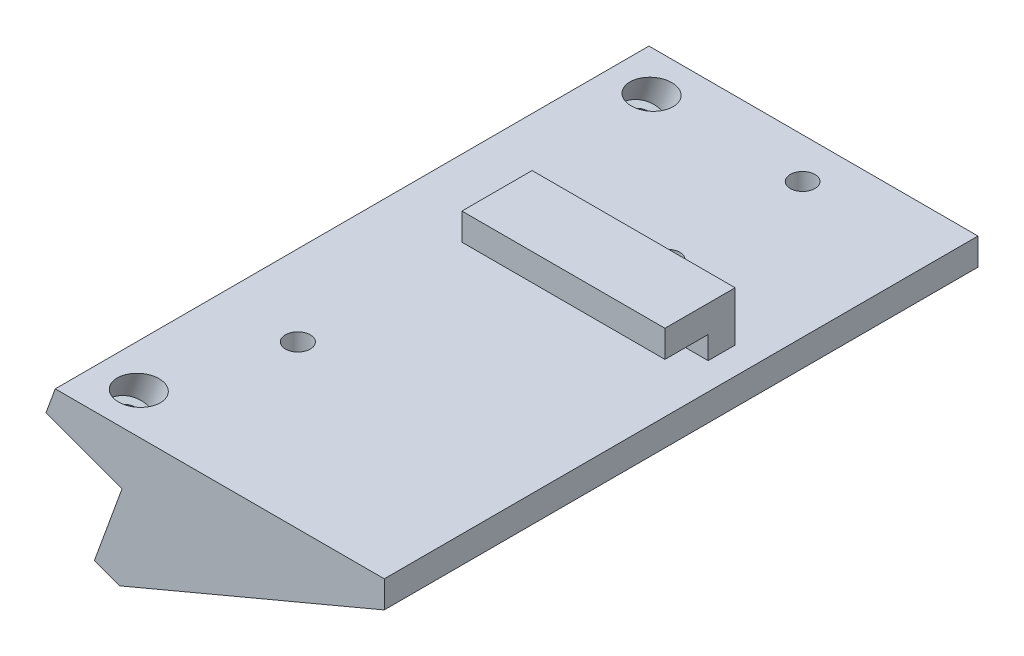
ISO-10303-21;
HEADER;
FILE_DESCRIPTION(('STEP AP214'),'2;1');
FILE_NAME('part.step','',(''),(''),'','','');
FILE_SCHEMA(('AUTOMOTIVE_DESIGN { 1 0 10303 214 1 1 1 1 }'));
ENDSEC;
DATA;
#1=APPLICATION_CONTEXT('core data for automotive mechanical design processes');
#2=APPLICATION_PROTOCOL_DEFINITION('international standard','automotive_design',2000,#1);
#3=PRODUCT_CONTEXT('',#1,'mechanical');
#4=PRODUCT('Part','Part','',(#3));
#5=PRODUCT_RELATED_PRODUCT_CATEGORY('part','',(#4));
#6=PRODUCT_DEFINITION_FORMATION('','',#4);
#7=PRODUCT_DEFINITION_CONTEXT('part definition',#1,'design');
#8=PRODUCT_DEFINITION('design','',#6,#7);
#9=PRODUCT_DEFINITION_SHAPE('','',#8);
#10=(LENGTH_UNIT() NAMED_UNIT(*) SI_UNIT(.MILLI.,.METRE.));
#11=(NAMED_UNIT(*) PLANE_ANGLE_UNIT() SI_UNIT($,.RADIAN.));
#12=(NAMED_UNIT(*) SI_UNIT($,.STERADIAN.) SOLID_ANGLE_UNIT());
#13=UNCERTAINTY_MEASURE_WITH_UNIT(LENGTH_MEASURE(1.E-05),#10,'distance_accuracy_value','');
#14=(GEOMETRIC_REPRESENTATION_CONTEXT(3) GLOBAL_UNCERTAINTY_ASSIGNED_CONTEXT((#13)) GLOBAL_UNIT_ASSIGNED_CONTEXT((#10,
#11,#12)) REPRESENTATION_CONTEXT('',''));
#15=CARTESIAN_POINT('',(0.,0.,0.));
#16=DIRECTION('',(0.,0.,1.));
#17=DIRECTION('',(1.,0.,0.));
#18=AXIS2_PLACEMENT_3D('',#15,#16,#17);
#19=CARTESIAN_POINT('',(0.,0.,0.));
#20=DIRECTION('',(0.,0.,-1.));
#21=DIRECTION('',(-1.,0.,0.));
#22=AXIS2_PLACEMENT_3D('',#19,#20,#21);
#23=PLANE('',#22);
#24=DIRECTION('',(0.,-1.,0.));
#25=VECTOR('',#24,1.);
#26=CARTESIAN_POINT('',(48.7076801418633,28.1241545656032,0.));
#27=LINE('',#26,#25);
#28=CARTESIAN_POINT('',(48.7076801418633,28.1241545656032,0.));
#29=VERTEX_POINT('',#28);
#30=CARTESIAN_POINT('',(48.7076801418633,23.9241545656032,0.));
#31=VERTEX_POINT('',#30);
#32=EDGE_CURVE('E147',#29,#31,#27,.T.);
#33=ORIENTED_EDGE('',*,*,#32,.F.);
#34=DIRECTION('',(1.,0.,0.));
#35=VECTOR('',#34,1.);
#36=CARTESIAN_POINT('',(-5.72631146135729,28.1241545656032,0.));
#37=LINE('',#36,#35);
#38=CARTESIAN_POINT('',(11.0935397099737,28.1241545656032,0.));
#39=VERTEX_POINT('',#38);
#40=EDGE_CURVE('E247',#39,#29,#37,.T.);
#41=ORIENTED_EDGE('',*,*,#40,.F.);
#42=DIRECTION('',(0.,-1.,0.));
#43=VECTOR('',#42,1.);
#44=CARTESIAN_POINT('',(11.0935397099737,0.,0.));
#45=LINE('',#44,#43);
#46=CARTESIAN_POINT('',(11.0935397099737,23.9241545656032,0.));
#47=VERTEX_POINT('',#46);
#48=EDGE_CURVE('E158',#39,#47,#45,.T.);
#49=ORIENTED_EDGE('',*,*,#48,.T.);
#50=DIRECTION('',(-1.,0.,0.));
#51=VECTOR('',#50,1.);
#52=CARTESIAN_POINT('',(-7.25498644527533,23.9241545656032,0.));
#53=LINE('',#52,#51);
#54=EDGE_CURVE('E143',#31,#47,#53,.T.);
#55=ORIENTED_EDGE('',*,*,#54,.F.);
#56=EDGE_LOOP('',(#33,#41,#49,#55));
#57=FACE_BOUND('',#56,.T.);
#58=ADVANCED_FACE('F41',(#57),#23,.F.);
#59=CARTESIAN_POINT('',(-3.9064602900263,33.1241545656032,-5.));
#60=DIRECTION('',(0.,-1.,0.));
#61=DIRECTION('',(1.,0.,0.));
#62=AXIS2_PLACEMENT_3D('',#59,#60,#61);
#63=PLANE('',#62);
#64=DIRECTION('',(0.,0.,1.));
#65=VECTOR('',#64,1.);
#66=CARTESIAN_POINT('',(48.7076801418633,33.1241545656032,-5.));
#67=LINE('',#66,#65);
#68=CARTESIAN_POINT('',(48.7076801418633,33.1241545656032,-5.));
#69=VERTEX_POINT('',#68);
#70=CARTESIAN_POINT('',(48.7076801418633,33.1241545656032,8.));
#71=VERTEX_POINT('',#70);
#72=EDGE_CURVE('E58',#69,#71,#67,.T.);
#73=ORIENTED_EDGE('',*,*,#72,.F.);
#74=DIRECTION('',(1.,0.,0.));
#75=VECTOR('',#74,1.);
#76=CARTESIAN_POINT('',(-3.9064602900263,33.1241545656032,-5.));
#77=LINE('',#76,#75);
#78=CARTESIAN_POINT('',(11.0935397099737,33.1241545656032,-5.));
#79=VERTEX_POINT('',#78);
#80=EDGE_CURVE('E160',#79,#69,#77,.T.);
#81=ORIENTED_EDGE('',*,*,#80,.F.);
#82=DIRECTION('',(0.,0.,1.));
#83=VECTOR('',#82,1.);
#84=CARTESIAN_POINT('',(11.0935397099737,33.1241545656032,-5.));
#85=LINE('',#84,#83);
#86=CARTESIAN_POINT('',(11.0935397099737,33.1241545656032,8.));
#87=VERTEX_POINT('',#86);
#88=EDGE_CURVE('E237',#79,#87,#85,.T.);
#89=ORIENTED_EDGE('',*,*,#88,.T.);
#90=DIRECTION('',(-1.,0.,0.));
#91=VECTOR('',#90,1.);
#92=CARTESIAN_POINT('',(53.7076801418633,33.1241545656032,8.));
#93=LINE('',#92,#91);
#94=EDGE_CURVE('E250',#71,#87,#93,.T.);
#95=ORIENTED_EDGE('',*,*,#94,.F.);
#96=EDGE_LOOP('',(#73,#81,#89,#95));
#97=FACE_BOUND('',#96,.T.);
#98=ADVANCED_FACE('F311',(#97),#63,.F.);
#99=CARTESIAN_POINT('',(0.,0.,-5.));
#100=DIRECTION('',(0.,0.,-1.));
#101=DIRECTION('',(-1.,0.,0.));
#102=AXIS2_PLACEMENT_3D('',#99,#100,#101);
#103=PLANE('',#102);
#104=ORIENTED_EDGE('',*,*,#80,.T.);
#105=DIRECTION('',(0.,1.,0.));
#106=VECTOR('',#105,1.);
#107=CARTESIAN_POINT('',(48.7076801418633,33.1241545656032,-5.));
#108=LINE('',#107,#106);
#109=CARTESIAN_POINT('',(48.7076801418633,23.9241545656032,-5.));
#110=VERTEX_POINT('',#109);
#111=EDGE_CURVE('E146',#110,#69,#108,.T.);
#112=ORIENTED_EDGE('',*,*,#111,.F.);
#113=DIRECTION('',(1.,0.,0.));
#114=VECTOR('',#113,1.);
#115=CARTESIAN_POINT('',(-7.25498644527533,23.9241545656032,-5.));
#116=LINE('',#115,#114);
#117=CARTESIAN_POINT('',(11.0935397099737,23.9241545656032,-5.));
#118=VERTEX_POINT('',#117);
#119=EDGE_CURVE('E11',#118,#110,#116,.T.);
#120=ORIENTED_EDGE('',*,*,#119,.F.);
#121=DIRECTION('',(0.,1.,0.));
#122=VECTOR('',#121,1.);
#123=CARTESIAN_POINT('',(11.0935397099737,23.9241545656032,-5.));
#124=LINE('',#123,#122);
#125=EDGE_CURVE('E232',#118,#79,#124,.T.);
#126=ORIENTED_EDGE('',*,*,#125,.T.);
#127=EDGE_LOOP('',(#104,#112,#120,#126));
#128=FACE_BOUND('',#127,.T.);
#129=ADVANCED_FACE('F317',(#128),#103,.T.);
#130=CARTESIAN_POINT('',(-5.72631146135729,28.1241545656032,8.));
#131=DIRECTION('',(0.,1.,0.));
#132=DIRECTION('',(0.,0.,1.));
#133=AXIS2_PLACEMENT_3D('',#130,#131,#132);
#134=PLANE('',#133);
#135=DIRECTION('',(0.,0.,-1.));
#136=VECTOR('',#135,1.);
#137=CARTESIAN_POINT('',(48.7076801418633,28.1241545656032,8.));
#138=LINE('',#137,#136);
#139=CARTESIAN_POINT('',(48.7076801418633,28.1241545656032,8.));
#140=VERTEX_POINT('',#139);
#141=EDGE_CURVE('E152',#140,#29,#138,.T.);
#142=ORIENTED_EDGE('',*,*,#141,.F.);
#143=DIRECTION('',(1.,0.,0.));
#144=VECTOR('',#143,1.);
#145=CARTESIAN_POINT('',(-5.72631146135729,28.1241545656032,8.));
#146=LINE('',#145,#144);
#147=CARTESIAN_POINT('',(11.0935397099737,28.1241545656032,8.));
#148=VERTEX_POINT('',#147);
#149=EDGE_CURVE('E166',#148,#140,#146,.T.);
#150=ORIENTED_EDGE('',*,*,#149,.F.);
#151=DIRECTION('',(0.,0.,-1.));
#152=VECTOR('',#151,1.);
#153=CARTESIAN_POINT('',(11.0935397099737,28.1241545656032,8.));
#154=LINE('',#153,#152);
#155=EDGE_CURVE('E66',#148,#39,#154,.T.);
#156=ORIENTED_EDGE('',*,*,#155,.T.);
#157=ORIENTED_EDGE('',*,*,#40,.T.);
#158=EDGE_LOOP('',(#142,#150,#156,#157));
#159=FACE_BOUND('',#158,.T.);
#160=ADVANCED_FACE('F343',(#159),#134,.F.);
#161=CARTESIAN_POINT('',(0.,0.,8.));
#162=DIRECTION('',(0.,0.,-1.));
#163=DIRECTION('',(-1.,0.,0.));
#164=AXIS2_PLACEMENT_3D('',#161,#162,#163);
#165=PLANE('',#164);
#166=DIRECTION('',(0.,-1.,0.));
#167=VECTOR('',#166,1.);
#168=CARTESIAN_POINT('',(48.7076801418633,28.1241545656032,8.));
#169=LINE('',#168,#167);
#170=EDGE_CURVE('E353',#71,#140,#169,.T.);
#171=ORIENTED_EDGE('',*,*,#170,.F.);
#172=ORIENTED_EDGE('',*,*,#94,.T.);
#173=DIRECTION('',(0.,-1.,0.));
#174=VECTOR('',#173,1.);
#175=CARTESIAN_POINT('',(11.0935397099737,0.,8.));
#176=LINE('',#175,#174);
#177=EDGE_CURVE('E50',#87,#148,#176,.T.);
#178=ORIENTED_EDGE('',*,*,#177,.T.);
#179=ORIENTED_EDGE('',*,*,#149,.T.);
#180=EDGE_LOOP('',(#171,#172,#178,#179));
#181=FACE_BOUND('',#180,.T.);
#182=ADVANCED_FACE('F341',(#181),#165,.F.);
#183=CARTESIAN_POINT('',(4.69846310392955,-1.71010071662833,65.));
#184=DIRECTION('',(0.342020143325665,0.93969262078591,0.));
#185=DIRECTION('',(-0.93969262078591,0.342020143325665,0.));
#186=AXIS2_PLACEMENT_3D('',#183,#184,#185);
#187=PLANE('',#186);
#188=DIRECTION('',(0.,0.,-1.));
#189=VECTOR('',#188,1.);
#190=CARTESIAN_POINT('',(0.,0.,65.));
#191=LINE('',#190,#189);
#192=CARTESIAN_POINT('',(0.,0.,65.));
#193=VERTEX_POINT('',#192);
#194=CARTESIAN_POINT('',(0.,0.,-45.));
#195=VERTEX_POINT('',#194);
#196=EDGE_CURVE('E172',#193,#195,#191,.T.);
#197=ORIENTED_EDGE('',*,*,#196,.T.);
#198=DIRECTION('',(-0.93969262078591,0.342020143325665,0.));
#199=VECTOR('',#198,1.);
#200=CARTESIAN_POINT('',(4.69846310392955,-1.71010071662833,-45.));
#201=LINE('',#200,#199);
#202=CARTESIAN_POINT('',(4.69846310392955,-1.71010071662833,-45.));
#203=VERTEX_POINT('',#202);
#204=EDGE_CURVE('E230',#203,#195,#201,.T.);
#205=ORIENTED_EDGE('',*,*,#204,.F.);
#206=DIRECTION('',(0.,0.,-1.));
#207=VECTOR('',#206,1.);
#208=CARTESIAN_POINT('',(4.69846310392955,-1.71010071662833,65.));
#209=LINE('',#208,#207);
#210=CARTESIAN_POINT('',(4.69846310392955,-1.71010071662833,65.));
#211=VERTEX_POINT('',#210);
#212=EDGE_CURVE('E184',#211,#203,#209,.T.);
#213=ORIENTED_EDGE('',*,*,#212,.F.);
#214=DIRECTION('',(0.93969262078591,-0.342020143325665,0.));
#215=VECTOR('',#214,1.);
#216=CARTESIAN_POINT('',(4.69846310392955,-1.71010071662833,65.));
#217=LINE('',#216,#215);
#218=EDGE_CURVE('E159',#193,#211,#217,.T.);
#219=ORIENTED_EDGE('',*,*,#218,.F.);
#220=EDGE_LOOP('',(#197,#205,#213,#219));
#221=FACE_BOUND('',#220,.T.);
#222=ADVANCED_FACE('F43',(#221),#187,.F.);
#223=CARTESIAN_POINT('',(53.7076801418633,18.9241545656032,65.));
#224=DIRECTION('',(-0.388037759372495,0.921643476242942,0.));
#225=DIRECTION('',(-0.921643476242942,-0.388037759372495,0.));
#226=AXIS2_PLACEMENT_3D('',#223,#224,#225);
#227=PLANE('',#226);
#228=ORIENTED_EDGE('',*,*,#212,.T.);
#229=DIRECTION('',(-0.921643476242942,-0.388037759372495,0.));
#230=VECTOR('',#229,1.);
#231=CARTESIAN_POINT('',(53.7076801418633,18.9241545656032,-45.));
#232=LINE('',#231,#230);
#233=CARTESIAN_POINT('',(53.7076801418633,18.9241545656032,-45.));
#234=VERTEX_POINT('',#233);
#235=EDGE_CURVE('E227',#234,#203,#232,.T.);
#236=ORIENTED_EDGE('',*,*,#235,.F.);
#237=DIRECTION('',(0.,0.,-1.));
#238=VECTOR('',#237,1.);
#239=CARTESIAN_POINT('',(53.7076801418633,18.9241545656032,65.));
#240=LINE('',#239,#238);
#241=CARTESIAN_POINT('',(53.7076801418633,18.9241545656032,65.));
#242=VERTEX_POINT('',#241);
#243=EDGE_CURVE('E182',#242,#234,#240,.T.);
#244=ORIENTED_EDGE('',*,*,#243,.F.);
#245=DIRECTION('',(0.921643476242942,0.388037759372495,0.));
#246=VECTOR('',#245,1.);
#247=CARTESIAN_POINT('',(53.7076801418633,18.9241545656032,65.));
#248=LINE('',#247,#246);
#249=EDGE_CURVE('E163',#211,#242,#248,.T.);
#250=ORIENTED_EDGE('',*,*,#249,.F.);
#251=EDGE_LOOP('',(#228,#236,#244,#250));
#252=FACE_BOUND('',#251,.T.);
#253=ADVANCED_FACE('F277',(#252),#227,.F.);
#254=CARTESIAN_POINT('',(53.7076801418633,23.9241545656032,65.));
#255=DIRECTION('',(-1.,0.,0.));
#256=DIRECTION('',(0.,0.,1.));
#257=AXIS2_PLACEMENT_3D('',#254,#255,#256);
#258=PLANE('',#257);
#259=DIRECTION('',(0.,-1.,0.));
#260=VECTOR('',#259,1.);
#261=CARTESIAN_POINT('',(53.7076801418633,23.9241545656032,-45.));
#262=LINE('',#261,#260);
#263=CARTESIAN_POINT('',(53.7076801418633,23.9241545656032,-45.));
#264=VERTEX_POINT('',#263);
#265=EDGE_CURVE('E224',#264,#234,#262,.T.);
#266=ORIENTED_EDGE('',*,*,#265,.F.);
#267=DIRECTION('',(0.,0.,-1.));
#268=VECTOR('',#267,1.);
#269=CARTESIAN_POINT('',(53.7076801418633,23.9241545656032,65.));
#270=LINE('',#269,#268);
#271=CARTESIAN_POINT('',(53.7076801418633,23.9241545656032,65.));
#272=VERTEX_POINT('',#271);
#273=EDGE_CURVE('E180',#272,#264,#270,.T.);
#274=ORIENTED_EDGE('',*,*,#273,.F.);
#275=DIRECTION('',(0.,1.,0.));
#276=VECTOR('',#275,1.);
#277=CARTESIAN_POINT('',(53.7076801418633,23.9241545656032,65.));
#278=LINE('',#277,#276);
#279=EDGE_CURVE('E256',#242,#272,#278,.T.);
#280=ORIENTED_EDGE('',*,*,#279,.F.);
#281=ORIENTED_EDGE('',*,*,#243,.T.);
#282=EDGE_LOOP('',(#266,#274,#280,#281));
#283=FACE_BOUND('',#282,.T.);
#284=ADVANCED_FACE('F285',(#283),#258,.F.);
#285=CARTESIAN_POINT('',(-7.25498644527533,23.9241545656032,65.));
#286=DIRECTION('',(0.,-1.,0.));
#287=DIRECTION('',(0.,0.,-1.));
#288=AXIS2_PLACEMENT_3D('',#285,#286,#287);
#289=PLANE('',#288);
#290=DIRECTION('',(0.,0.,-1.));
#291=VECTOR('',#290,1.);
#292=CARTESIAN_POINT('',(48.7076801418633,23.9241545656032,0.));
#293=LINE('',#292,#291);
#294=EDGE_CURVE('E137',#31,#110,#293,.T.);
#295=ORIENTED_EDGE('',*,*,#294,.F.);
#296=ORIENTED_EDGE('',*,*,#54,.T.);
#297=DIRECTION('',(0.,0.,1.));
#298=VECTOR('',#297,1.);
#299=CARTESIAN_POINT('',(11.0935397099737,23.9241545656032,-5.));
#300=LINE('',#299,#298);
#301=EDGE_CURVE('E236',#118,#47,#300,.T.);
#302=ORIENTED_EDGE('',*,*,#301,.F.);
#303=ORIENTED_EDGE('',*,*,#119,.T.);
#304=EDGE_LOOP('',(#295,#296,#302,#303));
#305=FACE_BOUND('',#304,.T.);
#306=CARTESIAN_POINT('',(28.7076801418633,23.9241545656032,-37.5));
#307=DIRECTION('',(0.,1.,0.));
#308=DIRECTION('',(0.,0.,1.));
#309=AXIS2_PLACEMENT_3D('',#306,#307,#308);
#310=CIRCLE('',#309,2.275);
#311=CARTESIAN_POINT('',(28.7076801418633,23.9241545656032,-35.225));
#312=VERTEX_POINT('',#311);
#313=EDGE_CURVE('E352',#312,#312,#310,.T.);
#314=ORIENTED_EDGE('',*,*,#313,.F.);
#315=EDGE_LOOP('',(#314));
#316=FACE_BOUND('',#315,.T.);
#317=CARTESIAN_POINT('',(28.7076801418633,23.9241545656032,-12.5));
#318=DIRECTION('',(0.,1.,0.));
#319=DIRECTION('',(0.,0.,1.));
#320=AXIS2_PLACEMENT_3D('',#317,#318,#319);
#321=CIRCLE('',#320,2.275);
#322=CARTESIAN_POINT('',(28.7076801418633,23.9241545656032,-10.225));
#323=VERTEX_POINT('',#322);
#324=EDGE_CURVE('E367',#323,#323,#321,.T.);
#325=ORIENTED_EDGE('',*,*,#324,.F.);
#326=EDGE_LOOP('',(#325));
#327=FACE_BOUND('',#326,.T.);
#328=CARTESIAN_POINT('',(0.726346848294002,23.9241545656032,57.5));
#329=DIRECTION('',(0.,-1.,0.));
#330=DIRECTION('',(-1.,0.,0.));
#331=AXIS2_PLACEMENT_3D('',#328,#329,#330);
#332=ELLIPSE('',#331,3.99066664678467,3.75);
#333=CARTESIAN_POINT('',(-3.26431979849066,23.9241545656032,57.5));
#334=VERTEX_POINT('',#333);
#335=EDGE_CURVE('E45',#334,#334,#332,.T.);
#336=ORIENTED_EDGE('',*,*,#335,.T.);
#337=EDGE_LOOP('',(#336));
#338=FACE_BOUND('',#337,.T.);
#339=CARTESIAN_POINT('',(0.726346848294002,23.9241545656032,-37.5));
#340=DIRECTION('',(0.,-1.,0.));
#341=DIRECTION('',(-1.,0.,0.));
#342=AXIS2_PLACEMENT_3D('',#339,#340,#341);
#343=ELLIPSE('',#342,3.99066664678467,3.75);
#344=CARTESIAN_POINT('',(-3.26431979849066,23.9241545656032,-37.5));
#345=VERTEX_POINT('',#344);
#346=EDGE_CURVE('E193',#345,#345,#343,.T.);
#347=ORIENTED_EDGE('',*,*,#346,.T.);
#348=EDGE_LOOP('',(#347));
#349=FACE_BOUND('',#348,.T.);
#350=CARTESIAN_POINT('',(7.69501355472467,23.9241545656032,35.));
#351=DIRECTION('',(0.,1.,0.));
#352=DIRECTION('',(0.,0.,1.));
#353=AXIS2_PLACEMENT_3D('',#350,#351,#352);
#354=CIRCLE('',#353,2.3);
#355=CARTESIAN_POINT('',(7.69501355472467,23.9241545656032,37.3));
#356=VERTEX_POINT('',#355);
#357=EDGE_CURVE('E243',#356,#356,#354,.T.);
#358=ORIENTED_EDGE('',*,*,#357,.F.);
#359=EDGE_LOOP('',(#358));
#360=FACE_BOUND('',#359,.T.);
#361=ORIENTED_EDGE('',*,*,#273,.T.);
#362=DIRECTION('',(1.,0.,0.));
#363=VECTOR('',#362,1.);
#364=CARTESIAN_POINT('',(-7.25498644527533,23.9241545656032,-45.));
#365=LINE('',#364,#363);
#366=CARTESIAN_POINT('',(-7.25498644527533,23.9241545656032,-45.));
#367=VERTEX_POINT('',#366);
#368=EDGE_CURVE('E221',#367,#264,#365,.T.);
#369=ORIENTED_EDGE('',*,*,#368,.F.);
#370=DIRECTION('',(0.,0.,-1.));
#371=VECTOR('',#370,1.);
#372=CARTESIAN_POINT('',(-7.25498644527533,23.9241545656032,65.));
#373=LINE('',#372,#371);
#374=CARTESIAN_POINT('',(-7.25498644527533,23.9241545656032,65.));
#375=VERTEX_POINT('',#374);
#376=EDGE_CURVE('E178',#375,#367,#373,.T.);
#377=ORIENTED_EDGE('',*,*,#376,.F.);
#378=DIRECTION('',(-1.,0.,0.));
#379=VECTOR('',#378,1.);
#380=CARTESIAN_POINT('',(-7.25498644527533,23.9241545656032,65.));
#381=LINE('',#380,#379);
#382=EDGE_CURVE('E258',#272,#375,#381,.T.);
#383=ORIENTED_EDGE('',*,*,#382,.F.);
#384=EDGE_LOOP('',(#361,#369,#377,#383));
#385=FACE_BOUND('',#384,.T.);
#386=ADVANCED_FACE('F139',(#305,#316,#327,#338,#349,#360,#385),#289,.F.);
#387=CARTESIAN_POINT('',(-8.96508716190366,19.2256914616736,65.));
#388=DIRECTION('',(0.93969262078591,-0.342020143325665,0.));
#389=DIRECTION('',(0.342020143325665,0.93969262078591,0.));
#390=AXIS2_PLACEMENT_3D('',#387,#388,#389);
#391=PLANE('',#390);
#392=ORIENTED_EDGE('',*,*,#376,.T.);
#393=DIRECTION('',(0.342020143325665,0.939692620785909,0.));
#394=VECTOR('',#393,1.);
#395=CARTESIAN_POINT('',(-8.96508716190366,19.2256914616736,-45.));
#396=LINE('',#395,#394);
#397=CARTESIAN_POINT('',(-8.96508716190366,19.2256914616736,-45.));
#398=VERTEX_POINT('',#397);
#399=EDGE_CURVE('E218',#398,#367,#396,.T.);
#400=ORIENTED_EDGE('',*,*,#399,.F.);
#401=DIRECTION('',(0.,0.,-1.));
#402=VECTOR('',#401,1.);
#403=CARTESIAN_POINT('',(-8.96508716190366,19.2256914616736,65.));
#404=LINE('',#403,#402);
#405=CARTESIAN_POINT('',(-8.96508716190366,19.2256914616736,65.));
#406=VERTEX_POINT('',#405);
#407=EDGE_CURVE('E176',#406,#398,#404,.T.);
#408=ORIENTED_EDGE('',*,*,#407,.F.);
#409=DIRECTION('',(-0.342020143325665,-0.939692620785909,0.));
#410=VECTOR('',#409,1.);
#411=CARTESIAN_POINT('',(-8.96508716190366,19.2256914616736,65.));
#412=LINE('',#411,#410);
#413=EDGE_CURVE('E260',#375,#406,#412,.T.);
#414=ORIENTED_EDGE('',*,*,#413,.F.);
#415=EDGE_LOOP('',(#392,#400,#408,#414));
#416=FACE_BOUND('',#415,.T.);
#417=ADVANCED_FACE('F294',(#416),#391,.F.);
#418=CARTESIAN_POINT('',(5.13030214988498,14.0953893117886,65.));
#419=DIRECTION('',(0.342020143325666,0.939692620785909,0.));
#420=DIRECTION('',(-0.93969262078591,0.342020143325666,0.));
#421=AXIS2_PLACEMENT_3D('',#418,#419,#420);
#422=PLANE('',#421);
#423=CARTESIAN_POINT('',(-1.91739250600933,16.6605403867311,57.5));
#424=DIRECTION('',(-0.342020143325666,-0.939692620785909,0.));
#425=DIRECTION('',(0.939692620785909,-0.342020143325666,0.));
#426=AXIS2_PLACEMENT_3D('',#423,#424,#425);
#427=CIRCLE('',#426,2.25);
#428=CARTESIAN_POINT('',(0.196915890758963,15.8909950642484,57.5));
#429=VERTEX_POINT('',#428);
#430=EDGE_CURVE('E198',#429,#429,#427,.T.);
#431=ORIENTED_EDGE('',*,*,#430,.F.);
#432=EDGE_LOOP('',(#431));
#433=FACE_BOUND('',#432,.T.);
#434=CARTESIAN_POINT('',(-1.91739250600933,16.6605403867311,-37.5));
#435=DIRECTION('',(-0.342020143325666,-0.939692620785909,0.));
#436=DIRECTION('',(0.939692620785909,-0.342020143325666,0.));
#437=AXIS2_PLACEMENT_3D('',#434,#435,#436);
#438=CIRCLE('',#437,2.25);
#439=CARTESIAN_POINT('',(0.196915890758963,15.8909950642484,-37.5));
#440=VERTEX_POINT('',#439);
#441=EDGE_CURVE('E202',#440,#440,#438,.T.);
#442=ORIENTED_EDGE('',*,*,#441,.F.);
#443=EDGE_LOOP('',(#442));
#444=FACE_BOUND('',#443,.T.);
#445=ORIENTED_EDGE('',*,*,#407,.T.);
#446=DIRECTION('',(-0.93969262078591,0.342020143325666,0.));
#447=VECTOR('',#446,1.);
#448=CARTESIAN_POINT('',(5.13030214988498,14.0953893117886,-45.));
#449=LINE('',#448,#447);
#450=CARTESIAN_POINT('',(5.13030214988498,14.0953893117886,-45.));
#451=VERTEX_POINT('',#450);
#452=EDGE_CURVE('E215',#451,#398,#449,.T.);
#453=ORIENTED_EDGE('',*,*,#452,.F.);
#454=DIRECTION('',(0.,0.,-1.));
#455=VECTOR('',#454,1.);
#456=CARTESIAN_POINT('',(5.13030214988498,14.0953893117886,65.));
#457=LINE('',#456,#455);
#458=CARTESIAN_POINT('',(5.13030214988498,14.0953893117886,65.));
#459=VERTEX_POINT('',#458);
#460=EDGE_CURVE('E174',#459,#451,#457,.T.);
#461=ORIENTED_EDGE('',*,*,#460,.F.);
#462=DIRECTION('',(0.93969262078591,-0.342020143325666,0.));
#463=VECTOR('',#462,1.);
#464=CARTESIAN_POINT('',(5.13030214988498,14.0953893117886,65.));
#465=LINE('',#464,#463);
#466=EDGE_CURVE('E261',#406,#459,#465,.T.);
#467=ORIENTED_EDGE('',*,*,#466,.F.);
#468=EDGE_LOOP('',(#445,#453,#461,#467));
#469=FACE_BOUND('',#468,.T.);
#470=ADVANCED_FACE('F297',(#433,#444,#469),#422,.F.);
#471=CARTESIAN_POINT('',(0.,0.,65.));
#472=DIRECTION('',(0.939692620785909,-0.342020143325666,0.));
#473=DIRECTION('',(0.342020143325666,0.93969262078591,0.));
#474=AXIS2_PLACEMENT_3D('',#471,#472,#473);
#475=PLANE('',#474);
#476=ORIENTED_EDGE('',*,*,#460,.T.);
#477=DIRECTION('',(0.342020143325666,0.939692620785909,0.));
#478=VECTOR('',#477,1.);
#479=CARTESIAN_POINT('',(0.,0.,-45.));
#480=LINE('',#479,#478);
#481=EDGE_CURVE('E207',#195,#451,#480,.T.);
#482=ORIENTED_EDGE('',*,*,#481,.F.);
#483=ORIENTED_EDGE('',*,*,#196,.F.);
#484=DIRECTION('',(-0.342020143325666,-0.939692620785909,0.));
#485=VECTOR('',#484,1.);
#486=CARTESIAN_POINT('',(0.,0.,65.));
#487=LINE('',#486,#485);
#488=EDGE_CURVE('E170',#459,#193,#487,.T.);
#489=ORIENTED_EDGE('',*,*,#488,.F.);
#490=EDGE_LOOP('',(#476,#482,#483,#489));
#491=FACE_BOUND('',#490,.T.);
#492=ADVANCED_FACE('F272',(#491),#475,.F.);
#493=CARTESIAN_POINT('',(0.,0.,65.));
#494=DIRECTION('',(0.,0.,-1.));
#495=DIRECTION('',(-1.,0.,0.));
#496=AXIS2_PLACEMENT_3D('',#493,#494,#495);
#497=PLANE('',#496);
#498=ORIENTED_EDGE('',*,*,#218,.T.);
#499=ORIENTED_EDGE('',*,*,#249,.T.);
#500=ORIENTED_EDGE('',*,*,#279,.T.);
#501=ORIENTED_EDGE('',*,*,#382,.T.);
#502=ORIENTED_EDGE('',*,*,#413,.T.);
#503=ORIENTED_EDGE('',*,*,#466,.T.);
#504=ORIENTED_EDGE('',*,*,#488,.T.);
#505=EDGE_LOOP('',(#498,#499,#500,#501,#502,#503,#504));
#506=FACE_BOUND('',#505,.T.);
#507=ADVANCED_FACE('F267',(#506),#497,.F.);
#508=CARTESIAN_POINT('',(7.69501355472467,20.4241545656032,35.));
#509=DIRECTION('',(0.,1.,0.));
#510=DIRECTION('',(0.,0.,1.));
#511=AXIS2_PLACEMENT_3D('',#508,#509,#510);
#512=CYLINDRICAL_SURFACE('',#511,2.3);
#513=CARTESIAN_POINT('',(7.69501355472467,20.4241545656032,35.));
#514=DIRECTION('',(0.,1.,0.));
#515=DIRECTION('',(0.,0.,1.));
#516=AXIS2_PLACEMENT_3D('',#513,#514,#515);
#517=CIRCLE('',#516,2.3);
#518=CARTESIAN_POINT('',(7.69501355472467,20.4241545656032,37.3));
#519=VERTEX_POINT('',#518);
#520=EDGE_CURVE('E244',#519,#519,#517,.T.);
#521=ORIENTED_EDGE('',*,*,#520,.F.);
#522=EDGE_LOOP('',(#521));
#523=FACE_BOUND('',#522,.T.);
#524=ORIENTED_EDGE('',*,*,#357,.T.);
#525=EDGE_LOOP('',(#524));
#526=FACE_BOUND('',#525,.T.);
#527=ADVANCED_FACE('F324',(#523,#526),#512,.F.);
#528=CARTESIAN_POINT('',(7.69501355472467,20.4241545656032,35.));
#529=DIRECTION('',(0.,1.,0.));
#530=DIRECTION('',(0.,0.,1.));
#531=AXIS2_PLACEMENT_3D('',#528,#529,#530);
#532=PLANE('',#531);
#533=ORIENTED_EDGE('',*,*,#520,.T.);
#534=EDGE_LOOP('',(#533));
#535=FACE_BOUND('',#534,.T.);
#536=ADVANCED_FACE('F328',(#535),#532,.T.);
#537=CARTESIAN_POINT('',(11.0935397099737,23.9241545656032,-5.));
#538=DIRECTION('',(1.,0.,0.));
#539=DIRECTION('',(0.,0.,-1.));
#540=AXIS2_PLACEMENT_3D('',#537,#538,#539);
#541=PLANE('',#540);
#542=ORIENTED_EDGE('',*,*,#155,.F.);
#543=ORIENTED_EDGE('',*,*,#177,.F.);
#544=ORIENTED_EDGE('',*,*,#88,.F.);
#545=ORIENTED_EDGE('',*,*,#125,.F.);
#546=ORIENTED_EDGE('',*,*,#301,.T.);
#547=ORIENTED_EDGE('',*,*,#48,.F.);
#548=EDGE_LOOP('',(#542,#543,#544,#545,#546,#547));
#549=FACE_BOUND('',#548,.T.);
#550=ADVANCED_FACE('F334',(#549),#541,.F.);
#551=CARTESIAN_POINT('',(0.,0.,-45.));
#552=DIRECTION('',(0.,0.,1.));
#553=DIRECTION('',(1.,0.,0.));
#554=AXIS2_PLACEMENT_3D('',#551,#552,#553);
#555=PLANE('',#554);
#556=ORIENTED_EDGE('',*,*,#481,.T.);
#557=ORIENTED_EDGE('',*,*,#452,.T.);
#558=ORIENTED_EDGE('',*,*,#399,.T.);
#559=ORIENTED_EDGE('',*,*,#368,.T.);
#560=ORIENTED_EDGE('',*,*,#265,.T.);
#561=ORIENTED_EDGE('',*,*,#235,.T.);
#562=ORIENTED_EDGE('',*,*,#204,.T.);
#563=EDGE_LOOP('',(#556,#557,#558,#559,#560,#561,#562));
#564=FACE_BOUND('',#563,.T.);
#565=ADVANCED_FACE('F280',(#564),#555,.F.);
#566=CARTESIAN_POINT('',(-1.91739250600933,16.6605403867311,-37.5));
#567=DIRECTION('',(-0.342020143325666,-0.939692620785909,0.));
#568=DIRECTION('',(0.939692620785909,-0.342020143325666,0.));
#569=AXIS2_PLACEMENT_3D('',#566,#567,#568);
#570=CYLINDRICAL_SURFACE('',#569,2.25);
#571=CARTESIAN_POINT('',(-1.233352219358,18.539925628303,-37.5));
#572=DIRECTION('',(-0.342020143325666,-0.939692620785909,0.));
#573=DIRECTION('',(0.939692620785909,-0.342020143325666,0.));
#574=AXIS2_PLACEMENT_3D('',#571,#572,#573);
#575=CIRCLE('',#574,2.25);
#576=CARTESIAN_POINT('',(0.880956177410292,17.7703803058202,-37.5));
#577=VERTEX_POINT('',#576);
#578=EDGE_CURVE('E190',#577,#577,#575,.F.);
#579=ORIENTED_EDGE('',*,*,#578,.T.);
#580=EDGE_LOOP('',(#579));
#581=FACE_BOUND('',#580,.T.);
#582=ORIENTED_EDGE('',*,*,#441,.T.);
#583=EDGE_LOOP('',(#582));
#584=FACE_BOUND('',#583,.T.);
#585=ADVANCED_FACE('F388',(#581,#584),#570,.F.);
#586=CARTESIAN_POINT('',(-1.91739250600933,16.6605403867311,57.5));
#587=DIRECTION('',(-0.342020143325666,-0.939692620785909,0.));
#588=DIRECTION('',(0.939692620785909,-0.342020143325666,0.));
#589=AXIS2_PLACEMENT_3D('',#586,#587,#588);
#590=CYLINDRICAL_SURFACE('',#589,2.25);
#591=CARTESIAN_POINT('',(-1.233352219358,18.539925628303,57.5));
#592=DIRECTION('',(-0.342020143325666,-0.939692620785909,0.));
#593=DIRECTION('',(0.939692620785909,-0.342020143325666,0.));
#594=AXIS2_PLACEMENT_3D('',#591,#592,#593);
#595=CIRCLE('',#594,2.25);
#596=CARTESIAN_POINT('',(0.880956177410292,17.7703803058202,57.5));
#597=VERTEX_POINT('',#596);
#598=EDGE_CURVE('E187',#597,#597,#595,.F.);
#599=ORIENTED_EDGE('',*,*,#598,.T.);
#600=EDGE_LOOP('',(#599));
#601=FACE_BOUND('',#600,.T.);
#602=ORIENTED_EDGE('',*,*,#430,.T.);
#603=EDGE_LOOP('',(#602));
#604=FACE_BOUND('',#603,.T.);
#605=ADVANCED_FACE('F390',(#601,#604),#590,.F.);
#606=CARTESIAN_POINT('',(9.88080852034998,49.07583129684,57.5));
#607=DIRECTION('',(-0.342020143325666,-0.939692620785909,0.));
#608=DIRECTION('',(0.939692620785909,-0.342020143325666,0.));
#609=AXIS2_PLACEMENT_3D('',#606,#607,#608);
#610=CYLINDRICAL_SURFACE('',#609,3.75);
#611=CARTESIAN_POINT('',(-1.233352219358,18.539925628303,57.5));
#612=DIRECTION('',(-0.342020143325666,-0.939692620785909,0.));
#613=DIRECTION('',(0.939692620785909,-0.342020143325666,0.));
#614=AXIS2_PLACEMENT_3D('',#611,#612,#613);
#615=CIRCLE('',#614,3.75);
#616=CARTESIAN_POINT('',(2.29049510858916,17.2573500908317,57.5));
#617=VERTEX_POINT('',#616);
#618=EDGE_CURVE('E191',#617,#617,#615,.T.);
#619=ORIENTED_EDGE('',*,*,#618,.T.);
#620=EDGE_LOOP('',(#619));
#621=FACE_BOUND('',#620,.T.);
#622=ORIENTED_EDGE('',*,*,#335,.F.);
#623=EDGE_LOOP('',(#622));
#624=FACE_BOUND('',#623,.T.);
#625=ADVANCED_FACE('F396',(#621,#624),#610,.F.);
#626=CARTESIAN_POINT('',(-1.233352219358,18.539925628303,57.5));
#627=DIRECTION('',(-0.342020143325666,-0.939692620785909,0.));
#628=DIRECTION('',(0.939692620785909,-0.342020143325666,0.));
#629=AXIS2_PLACEMENT_3D('',#626,#627,#628);
#630=PLANE('',#629);
#631=ORIENTED_EDGE('',*,*,#618,.F.);
#632=EDGE_LOOP('',(#631));
#633=FACE_BOUND('',#632,.T.);
#634=ORIENTED_EDGE('',*,*,#598,.F.);
#635=EDGE_LOOP('',(#634));
#636=FACE_BOUND('',#635,.T.);
#637=ADVANCED_FACE('F435',(#633,#636),#630,.F.);
#638=CARTESIAN_POINT('',(9.88080852034998,49.07583129684,-37.5));
#639=DIRECTION('',(-0.342020143325666,-0.939692620785909,0.));
#640=DIRECTION('',(0.939692620785909,-0.342020143325666,0.));
#641=AXIS2_PLACEMENT_3D('',#638,#639,#640);
#642=CYLINDRICAL_SURFACE('',#641,3.75);
#643=CARTESIAN_POINT('',(-1.233352219358,18.539925628303,-37.5));
#644=DIRECTION('',(-0.342020143325666,-0.939692620785909,0.));
#645=DIRECTION('',(0.939692620785909,-0.342020143325666,0.));
#646=AXIS2_PLACEMENT_3D('',#643,#644,#645);
#647=CIRCLE('',#646,3.75);
#648=CARTESIAN_POINT('',(2.29049510858916,17.2573500908317,-37.5));
#649=VERTEX_POINT('',#648);
#650=EDGE_CURVE('E210',#649,#649,#647,.T.);
#651=ORIENTED_EDGE('',*,*,#650,.T.);
#652=EDGE_LOOP('',(#651));
#653=FACE_BOUND('',#652,.T.);
#654=ORIENTED_EDGE('',*,*,#346,.F.);
#655=EDGE_LOOP('',(#654));
#656=FACE_BOUND('',#655,.T.);
#657=ADVANCED_FACE('F378',(#653,#656),#642,.F.);
#658=CARTESIAN_POINT('',(-1.233352219358,18.539925628303,-37.5));
#659=DIRECTION('',(-0.342020143325666,-0.939692620785909,0.));
#660=DIRECTION('',(0.939692620785909,-0.342020143325666,0.));
#661=AXIS2_PLACEMENT_3D('',#658,#659,#660);
#662=PLANE('',#661);
#663=ORIENTED_EDGE('',*,*,#650,.F.);
#664=EDGE_LOOP('',(#663));
#665=FACE_BOUND('',#664,.T.);
#666=ORIENTED_EDGE('',*,*,#578,.F.);
#667=EDGE_LOOP('',(#666));
#668=FACE_BOUND('',#667,.T.);
#669=ADVANCED_FACE('F381',(#665,#668),#662,.F.);
#670=CARTESIAN_POINT('',(28.7076801418633,20.4241545656032,-12.5));
#671=DIRECTION('',(0.,-1.,0.));
#672=DIRECTION('',(0.,0.,-1.));
#673=AXIS2_PLACEMENT_3D('',#670,#671,#672);
#674=PLANE('',#673);
#675=CARTESIAN_POINT('',(28.7076801418633,20.4241545656032,-12.5));
#676=DIRECTION('',(0.,1.,0.));
#677=DIRECTION('',(0.,0.,1.));
#678=AXIS2_PLACEMENT_3D('',#675,#676,#677);
#679=CIRCLE('',#678,2.275);
#680=CARTESIAN_POINT('',(28.7076801418633,20.4241545656032,-10.225));
#681=VERTEX_POINT('',#680);
#682=EDGE_CURVE('E370',#681,#681,#679,.T.);
#683=ORIENTED_EDGE('',*,*,#682,.T.);
#684=EDGE_LOOP('',(#683));
#685=FACE_BOUND('',#684,.T.);
#686=ADVANCED_FACE('F384',(#685),#674,.F.);
#687=CARTESIAN_POINT('',(28.7076801418633,23.9241545656032,-12.5));
#688=DIRECTION('',(0.,1.,0.));
#689=DIRECTION('',(0.,0.,1.));
#690=AXIS2_PLACEMENT_3D('',#687,#688,#689);
#691=CYLINDRICAL_SURFACE('',#690,2.275);
#692=ORIENTED_EDGE('',*,*,#682,.F.);
#693=EDGE_LOOP('',(#692));
#694=FACE_BOUND('',#693,.T.);
#695=ORIENTED_EDGE('',*,*,#324,.T.);
#696=EDGE_LOOP('',(#695));
#697=FACE_BOUND('',#696,.T.);
#698=ADVANCED_FACE('F467',(#694,#697),#691,.F.);
#699=CARTESIAN_POINT('',(28.7076801418633,20.4241545656032,-37.5));
#700=DIRECTION('',(0.,-1.,0.));
#701=DIRECTION('',(0.,0.,-1.));
#702=AXIS2_PLACEMENT_3D('',#699,#700,#701);
#703=PLANE('',#702);
#704=CARTESIAN_POINT('',(28.7076801418633,20.4241545656032,-37.5));
#705=DIRECTION('',(0.,1.,0.));
#706=DIRECTION('',(0.,0.,1.));
#707=AXIS2_PLACEMENT_3D('',#704,#705,#706);
#708=CIRCLE('',#707,2.275);
#709=CARTESIAN_POINT('',(28.7076801418633,20.4241545656032,-35.225));
#710=VERTEX_POINT('',#709);
#711=EDGE_CURVE('E364',#710,#710,#708,.T.);
#712=ORIENTED_EDGE('',*,*,#711,.T.);
#713=EDGE_LOOP('',(#712));
#714=FACE_BOUND('',#713,.T.);
#715=ADVANCED_FACE('F477',(#714),#703,.F.);
#716=CARTESIAN_POINT('',(28.7076801418633,23.9241545656032,-37.5));
#717=DIRECTION('',(0.,1.,0.));
#718=DIRECTION('',(0.,0.,1.));
#719=AXIS2_PLACEMENT_3D('',#716,#717,#718);
#720=CYLINDRICAL_SURFACE('',#719,2.275);
#721=ORIENTED_EDGE('',*,*,#711,.F.);
#722=EDGE_LOOP('',(#721));
#723=FACE_BOUND('',#722,.T.);
#724=ORIENTED_EDGE('',*,*,#313,.T.);
#725=EDGE_LOOP('',(#724));
#726=FACE_BOUND('',#725,.T.);
#727=ADVANCED_FACE('F487',(#723,#726),#720,.F.);
#728=CARTESIAN_POINT('',(48.7076801418633,0.,0.));
#729=DIRECTION('',(1.,0.,0.));
#730=DIRECTION('',(0.,0.,-1.));
#731=AXIS2_PLACEMENT_3D('',#728,#729,#730);
#732=PLANE('',#731);
#733=ORIENTED_EDGE('',*,*,#32,.T.);
#734=ORIENTED_EDGE('',*,*,#294,.T.);
#735=ORIENTED_EDGE('',*,*,#111,.T.);
#736=ORIENTED_EDGE('',*,*,#72,.T.);
#737=ORIENTED_EDGE('',*,*,#170,.T.);
#738=ORIENTED_EDGE('',*,*,#141,.T.);
#739=EDGE_LOOP('',(#733,#734,#735,#736,#737,#738));
#740=FACE_BOUND('',#739,.T.);
#741=ADVANCED_FACE('F150',(#740),#732,.T.);
#742=CLOSED_SHELL('',(#58,#98,#129,#160,#182,#222,#253,#284,#386,#417,#470,#492,#507,#527,#536,
#550,#565,#585,#605,#625,#637,#657,#669,#686,#698,#715,#727,#741));
#743=MANIFOLD_SOLID_BREP('B2',#742);
#744=ADVANCED_BREP_SHAPE_REPRESENTATION('',(#18,#743),#14);
#745=SHAPE_DEFINITION_REPRESENTATION(#9,#744);
ENDSEC;
END-ISO-10303-21;
